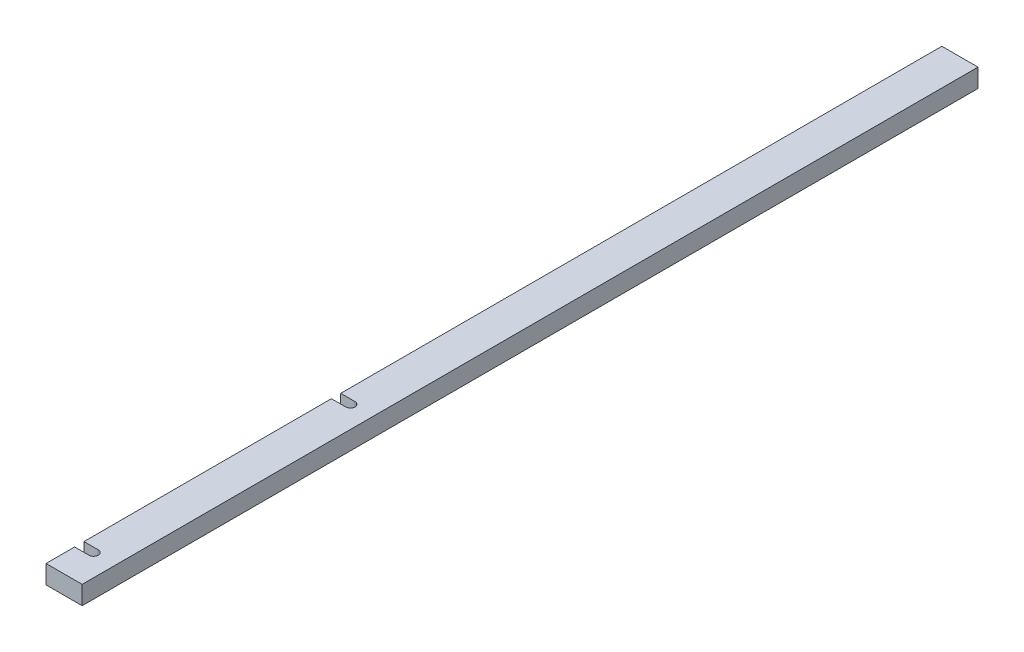
ISO-10303-21;
HEADER;
FILE_DESCRIPTION(('STEP AP214'),'2;1');
FILE_NAME('part.step','',(''),(''),'','','');
FILE_SCHEMA(('AUTOMOTIVE_DESIGN { 1 0 10303 214 1 1 1 1 }'));
ENDSEC;
DATA;
#1=APPLICATION_CONTEXT('core data for automotive mechanical design processes');
#2=APPLICATION_PROTOCOL_DEFINITION('international standard','automotive_design',2000,#1);
#3=PRODUCT_CONTEXT('',#1,'mechanical');
#4=PRODUCT('Part','Part','',(#3));
#5=PRODUCT_RELATED_PRODUCT_CATEGORY('part','',(#4));
#6=PRODUCT_DEFINITION_FORMATION('','',#4);
#7=PRODUCT_DEFINITION_CONTEXT('part definition',#1,'design');
#8=PRODUCT_DEFINITION('design','',#6,#7);
#9=PRODUCT_DEFINITION_SHAPE('','',#8);
#10=(LENGTH_UNIT() NAMED_UNIT(*) SI_UNIT(.MILLI.,.METRE.));
#11=(NAMED_UNIT(*) PLANE_ANGLE_UNIT() SI_UNIT($,.RADIAN.));
#12=(NAMED_UNIT(*) SI_UNIT($,.STERADIAN.) SOLID_ANGLE_UNIT());
#13=UNCERTAINTY_MEASURE_WITH_UNIT(LENGTH_MEASURE(1.E-05),#10,'distance_accuracy_value','');
#14=(GEOMETRIC_REPRESENTATION_CONTEXT(3) GLOBAL_UNCERTAINTY_ASSIGNED_CONTEXT((#13)) GLOBAL_UNIT_ASSIGNED_CONTEXT((#10,
#11,#12)) REPRESENTATION_CONTEXT('',''));
#15=CARTESIAN_POINT('',(0.,0.,0.));
#16=DIRECTION('',(0.,0.,1.));
#17=DIRECTION('',(1.,0.,0.));
#18=AXIS2_PLACEMENT_3D('',#15,#16,#17);
#19=CARTESIAN_POINT('',(-26.0808988764045,10.1005617977528,942.));
#20=DIRECTION('',(1.,0.,0.));
#21=DIRECTION('',(0.,1.,0.));
#22=AXIS2_PLACEMENT_3D('',#19,#20,#21);
#23=PLANE('',#22);
#24=DIRECTION('',(0.,0.,-1.));
#25=VECTOR('',#24,1.);
#26=CARTESIAN_POINT('',(-26.0808988764045,-9.39943820224719,942.));
#27=LINE('',#26,#25);
#28=CARTESIAN_POINT('',(-26.0808988764045,-9.39943820224719,632.1));
#29=VERTEX_POINT('',#28);
#30=CARTESIAN_POINT('',(-26.0808988764045,-9.39943820224719,0.));
#31=VERTEX_POINT('',#30);
#32=EDGE_CURVE('E204',#29,#31,#27,.T.);
#33=ORIENTED_EDGE('',*,*,#32,.F.);
#34=DIRECTION('',(0.,1.,0.));
#35=VECTOR('',#34,1.);
#36=CARTESIAN_POINT('',(-26.0808988764045,10.1005617977528,632.1));
#37=LINE('',#36,#35);
#38=CARTESIAN_POINT('',(-26.0808988764045,10.1005617977528,632.1));
#39=VERTEX_POINT('',#38);
#40=EDGE_CURVE('E171',#29,#39,#37,.T.);
#41=ORIENTED_EDGE('',*,*,#40,.T.);
#42=DIRECTION('',(0.,0.,-1.));
#43=VECTOR('',#42,1.);
#44=CARTESIAN_POINT('',(-26.0808988764045,10.1005617977528,942.));
#45=LINE('',#44,#43);
#46=CARTESIAN_POINT('',(-26.0808988764045,10.1005617977528,0.));
#47=VERTEX_POINT('',#46);
#48=EDGE_CURVE('E185',#39,#47,#45,.T.);
#49=ORIENTED_EDGE('',*,*,#48,.T.);
#50=DIRECTION('',(0.,-1.,0.));
#51=VECTOR('',#50,1.);
#52=CARTESIAN_POINT('',(-26.0808988764045,10.1005617977528,0.));
#53=LINE('',#52,#51);
#54=EDGE_CURVE('E174',#47,#31,#53,.T.);
#55=ORIENTED_EDGE('',*,*,#54,.T.);
#56=EDGE_LOOP('',(#33,#41,#49,#55));
#57=FACE_BOUND('',#56,.T.);
#58=ADVANCED_FACE('F39',(#57),#23,.F.);
#59=CARTESIAN_POINT('',(-26.0808988764045,10.1005617977528,902.1));
#60=VERTEX_POINT('',#59);
#61=CARTESIAN_POINT('',(-26.0808988764045,10.1005617977528,641.9));
#62=VERTEX_POINT('',#61);
#63=EDGE_CURVE('E198',#60,#62,#45,.T.);
#64=ORIENTED_EDGE('',*,*,#63,.T.);
#65=DIRECTION('',(0.,-1.,0.));
#66=VECTOR('',#65,1.);
#67=CARTESIAN_POINT('',(-26.0808988764045,10.1005617977528,641.9));
#68=LINE('',#67,#66);
#69=CARTESIAN_POINT('',(-26.0808988764045,-9.39943820224719,641.9));
#70=VERTEX_POINT('',#69);
#71=EDGE_CURVE('E54',#62,#70,#68,.T.);
#72=ORIENTED_EDGE('',*,*,#71,.T.);
#73=CARTESIAN_POINT('',(-26.0808988764045,-9.39943820224719,902.1));
#74=VERTEX_POINT('',#73);
#75=EDGE_CURVE('E150',#74,#70,#27,.T.);
#76=ORIENTED_EDGE('',*,*,#75,.F.);
#77=DIRECTION('',(0.,1.,0.));
#78=VECTOR('',#77,1.);
#79=CARTESIAN_POINT('',(-26.0808988764045,10.1005617977528,902.1));
#80=LINE('',#79,#78);
#81=EDGE_CURVE('E167',#74,#60,#80,.T.);
#82=ORIENTED_EDGE('',*,*,#81,.T.);
#83=EDGE_LOOP('',(#64,#72,#76,#82));
#84=FACE_BOUND('',#83,.T.);
#85=ADVANCED_FACE('F252',(#84),#23,.F.);
#86=CARTESIAN_POINT('',(-26.0808988764045,10.1005617977528,942.));
#87=VERTEX_POINT('',#86);
#88=CARTESIAN_POINT('',(-26.0808988764045,10.1005617977528,911.9));
#89=VERTEX_POINT('',#88);
#90=EDGE_CURVE('E194',#87,#89,#45,.T.);
#91=ORIENTED_EDGE('',*,*,#90,.T.);
#92=DIRECTION('',(0.,-1.,0.));
#93=VECTOR('',#92,1.);
#94=CARTESIAN_POINT('',(-26.0808988764045,10.1005617977528,911.9));
#95=LINE('',#94,#93);
#96=CARTESIAN_POINT('',(-26.0808988764045,-9.39943820224719,911.9));
#97=VERTEX_POINT('',#96);
#98=EDGE_CURVE('E62',#89,#97,#95,.T.);
#99=ORIENTED_EDGE('',*,*,#98,.T.);
#100=CARTESIAN_POINT('',(-26.0808988764045,-9.39943820224719,942.));
#101=VERTEX_POINT('',#100);
#102=EDGE_CURVE('E205',#101,#97,#27,.T.);
#103=ORIENTED_EDGE('',*,*,#102,.F.);
#104=DIRECTION('',(0.,-1.,0.));
#105=VECTOR('',#104,1.);
#106=CARTESIAN_POINT('',(-26.0808988764045,10.1005617977528,942.));
#107=LINE('',#106,#105);
#108=EDGE_CURVE('E175',#87,#101,#107,.T.);
#109=ORIENTED_EDGE('',*,*,#108,.F.);
#110=EDGE_LOOP('',(#91,#99,#103,#109));
#111=FACE_BOUND('',#110,.T.);
#112=ADVANCED_FACE('F41',(#111),#23,.F.);
#113=CARTESIAN_POINT('',(-26.0808988764045,-9.39943820224719,942.));
#114=DIRECTION('',(0.,1.,0.));
#115=DIRECTION('',(0.,0.,1.));
#116=AXIS2_PLACEMENT_3D('',#113,#114,#115);
#117=PLANE('',#116);
#118=CARTESIAN_POINT('',(-11.0808988764043,-9.39943820224719,637.));
#119=DIRECTION('',(0.,-1.,0.));
#120=DIRECTION('',(0.,0.,-1.));
#121=AXIS2_PLACEMENT_3D('',#118,#119,#120);
#122=CIRCLE('',#121,4.90000000000002);
#123=CARTESIAN_POINT('',(-11.0808988764043,-9.39943820224719,632.1));
#124=VERTEX_POINT('',#123);
#125=CARTESIAN_POINT('',(-11.0808988764043,-9.39943820224719,641.9));
#126=VERTEX_POINT('',#125);
#127=EDGE_CURVE('E138',#124,#126,#122,.T.);
#128=ORIENTED_EDGE('',*,*,#127,.F.);
#129=DIRECTION('',(1.,0.,0.));
#130=VECTOR('',#129,1.);
#131=CARTESIAN_POINT('',(-28.7069900626299,-9.39943820224719,632.1));
#132=LINE('',#131,#130);
#133=EDGE_CURVE('E135',#29,#124,#132,.T.);
#134=ORIENTED_EDGE('',*,*,#133,.F.);
#135=ORIENTED_EDGE('',*,*,#32,.T.);
#136=DIRECTION('',(1.,0.,0.));
#137=VECTOR('',#136,1.);
#138=CARTESIAN_POINT('',(-26.0808988764045,-9.39943820224719,0.));
#139=LINE('',#138,#137);
#140=CARTESIAN_POINT('',(11.9191011235955,-9.39943820224719,0.));
#141=VERTEX_POINT('',#140);
#142=EDGE_CURVE('E188',#31,#141,#139,.T.);
#143=ORIENTED_EDGE('',*,*,#142,.T.);
#144=DIRECTION('',(0.,0.,-1.));
#145=VECTOR('',#144,1.);
#146=CARTESIAN_POINT('',(11.9191011235955,-9.39943820224719,942.));
#147=LINE('',#146,#145);
#148=CARTESIAN_POINT('',(11.9191011235955,-9.39943820224719,942.));
#149=VERTEX_POINT('',#148);
#150=EDGE_CURVE('E201',#149,#141,#147,.T.);
#151=ORIENTED_EDGE('',*,*,#150,.F.);
#152=DIRECTION('',(1.,0.,0.));
#153=VECTOR('',#152,1.);
#154=CARTESIAN_POINT('',(-26.0808988764045,-9.39943820224719,942.));
#155=LINE('',#154,#153);
#156=EDGE_CURVE('E178',#101,#149,#155,.T.);
#157=ORIENTED_EDGE('',*,*,#156,.F.);
#158=ORIENTED_EDGE('',*,*,#102,.T.);
#159=DIRECTION('',(-1.,0.,0.));
#160=VECTOR('',#159,1.);
#161=CARTESIAN_POINT('',(-11.0808988764045,-9.39943820224719,911.9));
#162=LINE('',#161,#160);
#163=CARTESIAN_POINT('',(-11.0808988764045,-9.39943820224719,911.9));
#164=VERTEX_POINT('',#163);
#165=EDGE_CURVE('E162',#164,#97,#162,.T.);
#166=ORIENTED_EDGE('',*,*,#165,.F.);
#167=CARTESIAN_POINT('',(-11.0808988764045,-9.39943820224719,907.));
#168=DIRECTION('',(0.,-1.,0.));
#169=DIRECTION('',(0.,0.,-1.));
#170=AXIS2_PLACEMENT_3D('',#167,#168,#169);
#171=CIRCLE('',#170,4.90000000000002);
#172=CARTESIAN_POINT('',(-11.0808988764045,-9.39943820224719,902.1));
#173=VERTEX_POINT('',#172);
#174=EDGE_CURVE('E144',#173,#164,#171,.T.);
#175=ORIENTED_EDGE('',*,*,#174,.F.);
#176=DIRECTION('',(1.,0.,0.));
#177=VECTOR('',#176,1.);
#178=CARTESIAN_POINT('',(-32.6439069229004,-9.39943820224719,902.1));
#179=LINE('',#178,#177);
#180=EDGE_CURVE('E157',#74,#173,#179,.T.);
#181=ORIENTED_EDGE('',*,*,#180,.F.);
#182=ORIENTED_EDGE('',*,*,#75,.T.);
#183=DIRECTION('',(-1.,0.,0.));
#184=VECTOR('',#183,1.);
#185=CARTESIAN_POINT('',(-11.0808988764043,-9.39943820224719,641.9));
#186=LINE('',#185,#184);
#187=EDGE_CURVE('E130',#126,#70,#186,.T.);
#188=ORIENTED_EDGE('',*,*,#187,.F.);
#189=EDGE_LOOP('',(#128,#134,#135,#143,#151,#157,#158,#166,#175,#181,#182,#188));
#190=FACE_BOUND('',#189,.T.);
#191=ADVANCED_FACE('F147',(#190),#117,.F.);
#192=CARTESIAN_POINT('',(11.9191011235955,10.1005617977528,942.));
#193=DIRECTION('',(-1.,0.,0.));
#194=DIRECTION('',(0.,0.,1.));
#195=AXIS2_PLACEMENT_3D('',#192,#193,#194);
#196=PLANE('',#195);
#197=DIRECTION('',(0.,1.,0.));
#198=VECTOR('',#197,1.);
#199=CARTESIAN_POINT('',(11.9191011235955,10.1005617977528,0.));
#200=LINE('',#199,#198);
#201=CARTESIAN_POINT('',(11.9191011235955,10.1005617977528,0.));
#202=VERTEX_POINT('',#201);
#203=EDGE_CURVE('E190',#141,#202,#200,.T.);
#204=ORIENTED_EDGE('',*,*,#203,.T.);
#205=DIRECTION('',(0.,0.,-1.));
#206=VECTOR('',#205,1.);
#207=CARTESIAN_POINT('',(11.9191011235955,10.1005617977528,942.));
#208=LINE('',#207,#206);
#209=CARTESIAN_POINT('',(11.9191011235955,10.1005617977528,942.));
#210=VERTEX_POINT('',#209);
#211=EDGE_CURVE('E197',#210,#202,#208,.T.);
#212=ORIENTED_EDGE('',*,*,#211,.F.);
#213=DIRECTION('',(0.,1.,0.));
#214=VECTOR('',#213,1.);
#215=CARTESIAN_POINT('',(11.9191011235955,10.1005617977528,942.));
#216=LINE('',#215,#214);
#217=EDGE_CURVE('E181',#149,#210,#216,.T.);
#218=ORIENTED_EDGE('',*,*,#217,.F.);
#219=ORIENTED_EDGE('',*,*,#150,.T.);
#220=EDGE_LOOP('',(#204,#212,#218,#219));
#221=FACE_BOUND('',#220,.T.);
#222=ADVANCED_FACE('F234',(#221),#196,.F.);
#223=CARTESIAN_POINT('',(-26.0808988764045,10.1005617977528,942.));
#224=DIRECTION('',(0.,-1.,0.));
#225=DIRECTION('',(0.,0.,-1.));
#226=AXIS2_PLACEMENT_3D('',#223,#224,#225);
#227=PLANE('',#226);
#228=ORIENTED_EDGE('',*,*,#48,.F.);
#229=DIRECTION('',(1.,0.,0.));
#230=VECTOR('',#229,1.);
#231=CARTESIAN_POINT('',(-26.0808988764045,10.1005617977528,632.1));
#232=LINE('',#231,#230);
#233=CARTESIAN_POINT('',(-11.0808988764043,10.1005617977528,632.1));
#234=VERTEX_POINT('',#233);
#235=EDGE_CURVE('E11',#39,#234,#232,.T.);
#236=ORIENTED_EDGE('',*,*,#235,.T.);
#237=CARTESIAN_POINT('',(-11.0808988764043,10.1005617977528,637.));
#238=DIRECTION('',(0.,-1.,0.));
#239=DIRECTION('',(0.,0.,-1.));
#240=AXIS2_PLACEMENT_3D('',#237,#238,#239);
#241=CIRCLE('',#240,4.90000000000002);
#242=CARTESIAN_POINT('',(-11.0808988764043,10.1005617977528,641.9));
#243=VERTEX_POINT('',#242);
#244=EDGE_CURVE('E47',#234,#243,#241,.T.);
#245=ORIENTED_EDGE('',*,*,#244,.T.);
#246=DIRECTION('',(-1.,0.,0.));
#247=VECTOR('',#246,1.);
#248=CARTESIAN_POINT('',(-26.0808988764045,10.1005617977528,641.9));
#249=LINE('',#248,#247);
#250=EDGE_CURVE('E131',#243,#62,#249,.T.);
#251=ORIENTED_EDGE('',*,*,#250,.T.);
#252=ORIENTED_EDGE('',*,*,#63,.F.);
#253=DIRECTION('',(1.,0.,0.));
#254=VECTOR('',#253,1.);
#255=CARTESIAN_POINT('',(-26.0808988764045,10.1005617977528,902.1));
#256=LINE('',#255,#254);
#257=CARTESIAN_POINT('',(-11.0808988764045,10.1005617977528,902.1));
#258=VERTEX_POINT('',#257);
#259=EDGE_CURVE('E213',#60,#258,#256,.T.);
#260=ORIENTED_EDGE('',*,*,#259,.T.);
#261=CARTESIAN_POINT('',(-11.0808988764045,10.1005617977528,907.));
#262=DIRECTION('',(0.,-1.,0.));
#263=DIRECTION('',(0.,0.,-1.));
#264=AXIS2_PLACEMENT_3D('',#261,#262,#263);
#265=CIRCLE('',#264,4.90000000000002);
#266=CARTESIAN_POINT('',(-11.0808988764045,10.1005617977528,911.9));
#267=VERTEX_POINT('',#266);
#268=EDGE_CURVE('E210',#258,#267,#265,.T.);
#269=ORIENTED_EDGE('',*,*,#268,.T.);
#270=DIRECTION('',(-1.,0.,0.));
#271=VECTOR('',#270,1.);
#272=CARTESIAN_POINT('',(-26.0808988764045,10.1005617977528,911.9));
#273=LINE('',#272,#271);
#274=EDGE_CURVE('E208',#267,#89,#273,.T.);
#275=ORIENTED_EDGE('',*,*,#274,.T.);
#276=ORIENTED_EDGE('',*,*,#90,.F.);
#277=DIRECTION('',(-1.,0.,0.));
#278=VECTOR('',#277,1.);
#279=CARTESIAN_POINT('',(-26.0808988764045,10.1005617977528,942.));
#280=LINE('',#279,#278);
#281=EDGE_CURVE('E183',#210,#87,#280,.T.);
#282=ORIENTED_EDGE('',*,*,#281,.F.);
#283=ORIENTED_EDGE('',*,*,#211,.T.);
#284=DIRECTION('',(-1.,0.,0.));
#285=VECTOR('',#284,1.);
#286=CARTESIAN_POINT('',(-26.0808988764045,10.1005617977528,0.));
#287=LINE('',#286,#285);
#288=EDGE_CURVE('E179',#202,#47,#287,.T.);
#289=ORIENTED_EDGE('',*,*,#288,.T.);
#290=EDGE_LOOP('',(#228,#236,#245,#251,#252,#260,#269,#275,#276,#282,#283,#289));
#291=FACE_BOUND('',#290,.T.);
#292=ADVANCED_FACE('F218',(#291),#227,.F.);
#293=CARTESIAN_POINT('',(0.,0.,942.));
#294=DIRECTION('',(0.,0.,1.));
#295=DIRECTION('',(1.,0.,0.));
#296=AXIS2_PLACEMENT_3D('',#293,#294,#295);
#297=PLANE('',#296);
#298=ORIENTED_EDGE('',*,*,#108,.T.);
#299=ORIENTED_EDGE('',*,*,#156,.T.);
#300=ORIENTED_EDGE('',*,*,#217,.T.);
#301=ORIENTED_EDGE('',*,*,#281,.T.);
#302=EDGE_LOOP('',(#298,#299,#300,#301));
#303=FACE_BOUND('',#302,.T.);
#304=ADVANCED_FACE('F238',(#303),#297,.T.);
#305=CARTESIAN_POINT('',(0.,0.,0.));
#306=DIRECTION('',(0.,0.,1.));
#307=DIRECTION('',(1.,0.,0.));
#308=AXIS2_PLACEMENT_3D('',#305,#306,#307);
#309=PLANE('',#308);
#310=ORIENTED_EDGE('',*,*,#54,.F.);
#311=ORIENTED_EDGE('',*,*,#288,.F.);
#312=ORIENTED_EDGE('',*,*,#203,.F.);
#313=ORIENTED_EDGE('',*,*,#142,.F.);
#314=EDGE_LOOP('',(#310,#311,#312,#313));
#315=FACE_BOUND('',#314,.T.);
#316=ADVANCED_FACE('F229',(#315),#309,.F.);
#317=CARTESIAN_POINT('',(-11.0808988764045,51.6005617977528,907.));
#318=DIRECTION('',(0.,-1.,0.));
#319=DIRECTION('',(0.,0.,-1.));
#320=AXIS2_PLACEMENT_3D('',#317,#318,#319);
#321=CYLINDRICAL_SURFACE('',#320,4.90000000000002);
#322=DIRECTION('',(0.,-1.,0.));
#323=VECTOR('',#322,1.);
#324=CARTESIAN_POINT('',(-11.0808988764045,51.6005617977528,902.1));
#325=LINE('',#324,#323);
#326=EDGE_CURVE('E158',#258,#173,#325,.T.);
#327=ORIENTED_EDGE('',*,*,#326,.T.);
#328=ORIENTED_EDGE('',*,*,#174,.T.);
#329=DIRECTION('',(0.,-1.,0.));
#330=VECTOR('',#329,1.);
#331=CARTESIAN_POINT('',(-11.0808988764045,51.6005617977528,911.9));
#332=LINE('',#331,#330);
#333=EDGE_CURVE('E155',#267,#164,#332,.T.);
#334=ORIENTED_EDGE('',*,*,#333,.F.);
#335=ORIENTED_EDGE('',*,*,#268,.F.);
#336=EDGE_LOOP('',(#327,#328,#334,#335));
#337=FACE_BOUND('',#336,.T.);
#338=ADVANCED_FACE('F248',(#337),#321,.F.);
#339=CARTESIAN_POINT('',(-32.6439069229004,51.6005617977528,902.1));
#340=DIRECTION('',(0.,0.,-1.));
#341=DIRECTION('',(-1.,0.,0.));
#342=AXIS2_PLACEMENT_3D('',#339,#340,#341);
#343=PLANE('',#342);
#344=ORIENTED_EDGE('',*,*,#180,.T.);
#345=ORIENTED_EDGE('',*,*,#326,.F.);
#346=ORIENTED_EDGE('',*,*,#259,.F.);
#347=ORIENTED_EDGE('',*,*,#81,.F.);
#348=EDGE_LOOP('',(#344,#345,#346,#347));
#349=FACE_BOUND('',#348,.T.);
#350=ADVANCED_FACE('F253',(#349),#343,.F.);
#351=CARTESIAN_POINT('',(-11.0808988764045,51.6005617977528,911.9));
#352=DIRECTION('',(0.,0.,1.));
#353=DIRECTION('',(1.,0.,0.));
#354=AXIS2_PLACEMENT_3D('',#351,#352,#353);
#355=PLANE('',#354);
#356=ORIENTED_EDGE('',*,*,#274,.F.);
#357=ORIENTED_EDGE('',*,*,#333,.T.);
#358=ORIENTED_EDGE('',*,*,#165,.T.);
#359=ORIENTED_EDGE('',*,*,#98,.F.);
#360=EDGE_LOOP('',(#356,#357,#358,#359));
#361=FACE_BOUND('',#360,.T.);
#362=ADVANCED_FACE('F246',(#361),#355,.F.);
#363=CARTESIAN_POINT('',(-11.0808988764043,51.6005617977528,637.));
#364=DIRECTION('',(0.,-1.,0.));
#365=DIRECTION('',(0.,0.,-1.));
#366=AXIS2_PLACEMENT_3D('',#363,#364,#365);
#367=CYLINDRICAL_SURFACE('',#366,4.90000000000002);
#368=DIRECTION('',(0.,-1.,0.));
#369=VECTOR('',#368,1.);
#370=CARTESIAN_POINT('',(-11.0808988764043,51.6005617977528,632.1));
#371=LINE('',#370,#369);
#372=EDGE_CURVE('E134',#234,#124,#371,.T.);
#373=ORIENTED_EDGE('',*,*,#372,.T.);
#374=ORIENTED_EDGE('',*,*,#127,.T.);
#375=DIRECTION('',(0.,-1.,0.));
#376=VECTOR('',#375,1.);
#377=CARTESIAN_POINT('',(-11.0808988764043,51.6005617977528,641.9));
#378=LINE('',#377,#376);
#379=EDGE_CURVE('E126',#243,#126,#378,.T.);
#380=ORIENTED_EDGE('',*,*,#379,.F.);
#381=ORIENTED_EDGE('',*,*,#244,.F.);
#382=EDGE_LOOP('',(#373,#374,#380,#381));
#383=FACE_BOUND('',#382,.T.);
#384=ADVANCED_FACE('F139',(#383),#367,.F.);
#385=CARTESIAN_POINT('',(-28.7069900626299,51.6005617977528,632.1));
#386=DIRECTION('',(0.,0.,-1.));
#387=DIRECTION('',(-1.,0.,0.));
#388=AXIS2_PLACEMENT_3D('',#385,#386,#387);
#389=PLANE('',#388);
#390=ORIENTED_EDGE('',*,*,#133,.T.);
#391=ORIENTED_EDGE('',*,*,#372,.F.);
#392=ORIENTED_EDGE('',*,*,#235,.F.);
#393=ORIENTED_EDGE('',*,*,#40,.F.);
#394=EDGE_LOOP('',(#390,#391,#392,#393));
#395=FACE_BOUND('',#394,.T.);
#396=ADVANCED_FACE('F222',(#395),#389,.F.);
#397=CARTESIAN_POINT('',(-11.0808988764043,51.6005617977528,641.9));
#398=DIRECTION('',(0.,0.,1.));
#399=DIRECTION('',(1.,0.,0.));
#400=AXIS2_PLACEMENT_3D('',#397,#398,#399);
#401=PLANE('',#400);
#402=ORIENTED_EDGE('',*,*,#250,.F.);
#403=ORIENTED_EDGE('',*,*,#379,.T.);
#404=ORIENTED_EDGE('',*,*,#187,.T.);
#405=ORIENTED_EDGE('',*,*,#71,.F.);
#406=EDGE_LOOP('',(#402,#403,#404,#405));
#407=FACE_BOUND('',#406,.T.);
#408=ADVANCED_FACE('F128',(#407),#401,.F.);
#409=CLOSED_SHELL('',(#58,#85,#112,#191,#222,#292,#304,#316,#338,#350,#362,#384,#396,#408));
#410=MANIFOLD_SOLID_BREP('B2',#409);
#411=ADVANCED_BREP_SHAPE_REPRESENTATION('',(#18,#410),#14);
#412=SHAPE_DEFINITION_REPRESENTATION(#9,#411);
ENDSEC;
END-ISO-10303-21;
